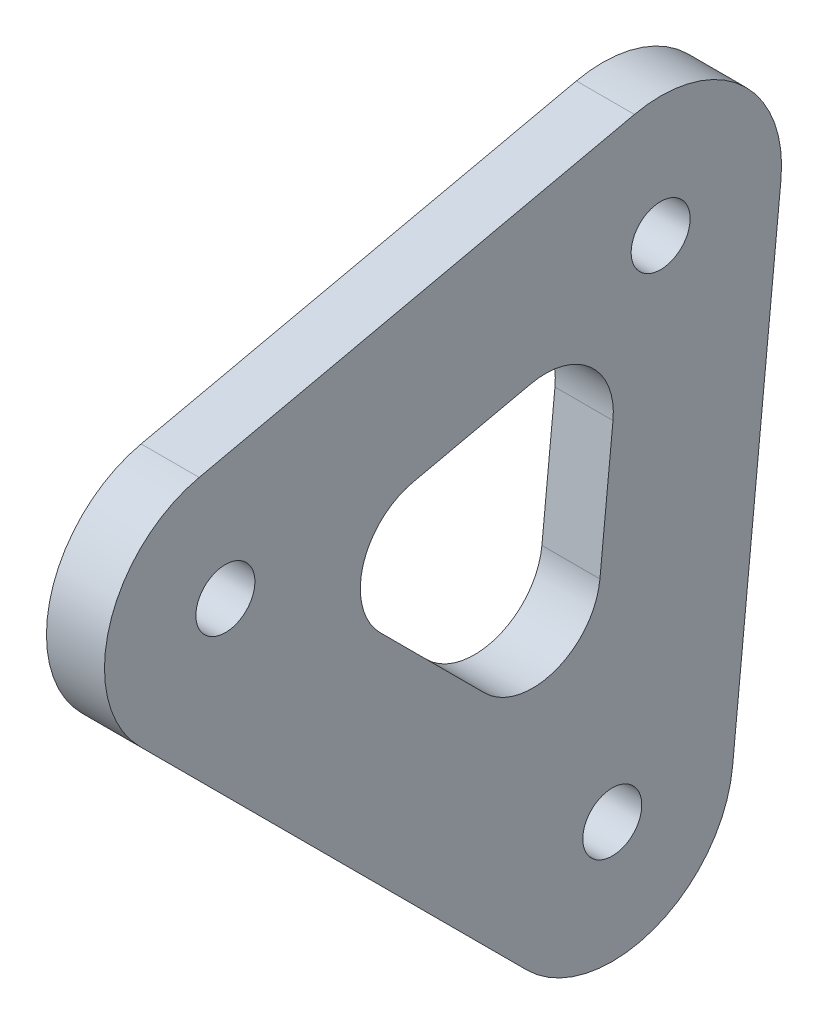
ISO-10303-21;
HEADER;
FILE_DESCRIPTION(('STEP AP214'),'2;1');
FILE_NAME('part.step','',(''),(''),'','','');
FILE_SCHEMA(('AUTOMOTIVE_DESIGN { 1 0 10303 214 1 1 1 1 }'));
ENDSEC;
DATA;
#1=APPLICATION_CONTEXT('core data for automotive mechanical design processes');
#2=APPLICATION_PROTOCOL_DEFINITION('international standard','automotive_design',2000,#1);
#3=PRODUCT_CONTEXT('',#1,'mechanical');
#4=PRODUCT('Part','Part','',(#3));
#5=PRODUCT_RELATED_PRODUCT_CATEGORY('part','',(#4));
#6=PRODUCT_DEFINITION_FORMATION('','',#4);
#7=PRODUCT_DEFINITION_CONTEXT('part definition',#1,'design');
#8=PRODUCT_DEFINITION('design','',#6,#7);
#9=PRODUCT_DEFINITION_SHAPE('','',#8);
#10=(LENGTH_UNIT() NAMED_UNIT(*) SI_UNIT(.MILLI.,.METRE.));
#11=(NAMED_UNIT(*) PLANE_ANGLE_UNIT() SI_UNIT($,.RADIAN.));
#12=(NAMED_UNIT(*) SI_UNIT($,.STERADIAN.) SOLID_ANGLE_UNIT());
#13=UNCERTAINTY_MEASURE_WITH_UNIT(LENGTH_MEASURE(1.E-05),#10,'distance_accuracy_value','');
#14=(GEOMETRIC_REPRESENTATION_CONTEXT(3) GLOBAL_UNCERTAINTY_ASSIGNED_CONTEXT((#13)) GLOBAL_UNIT_ASSIGNED_CONTEXT((#10,
#11,#12)) REPRESENTATION_CONTEXT('',''));
#15=CARTESIAN_POINT('',(0.,0.,0.));
#16=DIRECTION('',(0.,0.,1.));
#17=DIRECTION('',(1.,0.,0.));
#18=AXIS2_PLACEMENT_3D('',#15,#16,#17);
#19=CARTESIAN_POINT('',(-1.5,0.,0.));
#20=DIRECTION('',(1.,0.,0.));
#21=DIRECTION('',(0.,0.,-1.));
#22=AXIS2_PLACEMENT_3D('',#19,#20,#21);
#23=PLANE('',#22);
#24=CARTESIAN_POINT('',(-1.5,0.,0.));
#25=DIRECTION('',(-1.,0.,0.));
#26=DIRECTION('',(0.,0.,1.));
#27=AXIS2_PLACEMENT_3D('',#24,#25,#26);
#28=CIRCLE('',#27,1.525);
#29=CARTESIAN_POINT('',(-1.5,0.,1.525));
#30=VERTEX_POINT('',#29);
#31=EDGE_CURVE('E174',#30,#30,#28,.F.);
#32=ORIENTED_EDGE('',*,*,#31,.T.);
#33=EDGE_LOOP('',(#32));
#34=FACE_BOUND('',#33,.T.);
#35=CARTESIAN_POINT('',(-1.5,20.,20.));
#36=DIRECTION('',(-1.,0.,0.));
#37=DIRECTION('',(0.,0.,1.));
#38=AXIS2_PLACEMENT_3D('',#35,#36,#37);
#39=CIRCLE('',#38,1.525);
#40=CARTESIAN_POINT('',(-1.5,20.,21.525));
#41=VERTEX_POINT('',#40);
#42=EDGE_CURVE('E131',#41,#41,#39,.F.);
#43=ORIENTED_EDGE('',*,*,#42,.T.);
#44=EDGE_LOOP('',(#43));
#45=FACE_BOUND('',#44,.T.);
#46=DIRECTION('',(0.,-0.995037190209989,0.0995037190209988));
#47=VECTOR('',#46,1.);
#48=CARTESIAN_POINT('',(-1.5,-0.621898243881243,-6.21898243881244));
#49=LINE('',#48,#47);
#50=CARTESIAN_POINT('',(-1.5,24.3781017561188,-8.71898243881243));
#51=VERTEX_POINT('',#50);
#52=CARTESIAN_POINT('',(-1.5,-0.621898243881243,-6.21898243881244));
#53=VERTEX_POINT('',#52);
#54=EDGE_CURVE('E128',#51,#53,#49,.T.);
#55=ORIENTED_EDGE('',*,*,#54,.T.);
#56=CARTESIAN_POINT('',(-1.5,0.,0.));
#57=DIRECTION('',(-1.,0.,0.));
#58=DIRECTION('',(0.,0.,1.));
#59=AXIS2_PLACEMENT_3D('',#56,#57,#58);
#60=CIRCLE('',#59,6.25);
#61=CARTESIAN_POINT('',(-1.5,-4.41941738241592,4.41941738241592));
#62=VERTEX_POINT('',#61);
#63=EDGE_CURVE('E136',#62,#53,#60,.F.);
#64=ORIENTED_EDGE('',*,*,#63,.F.);
#65=DIRECTION('',(0.,0.707106781186548,0.707106781186548));
#66=VECTOR('',#65,1.);
#67=CARTESIAN_POINT('',(-1.5,-4.41941738241592,4.41941738241592));
#68=LINE('',#67,#66);
#69=CARTESIAN_POINT('',(-1.5,15.5805826175841,24.4194173824159));
#70=VERTEX_POINT('',#69);
#71=EDGE_CURVE('E133',#62,#70,#68,.T.);
#72=ORIENTED_EDGE('',*,*,#71,.T.);
#73=CARTESIAN_POINT('',(-1.5,20.,20.));
#74=DIRECTION('',(-1.,0.,0.));
#75=DIRECTION('',(0.,0.,1.));
#76=AXIS2_PLACEMENT_3D('',#73,#74,#75);
#77=CIRCLE('',#76,6.25);
#78=CARTESIAN_POINT('',(-1.5,26.1011691261497,21.3558153613666));
#79=VERTEX_POINT('',#78);
#80=EDGE_CURVE('E181',#79,#70,#77,.F.);
#81=ORIENTED_EDGE('',*,*,#80,.F.);
#82=DIRECTION('',(0.,-0.216930457818656,0.976187060183953));
#83=VECTOR('',#82,1.);
#84=CARTESIAN_POINT('',(-1.5,29.3952867732085,6.5322859496019));
#85=LINE('',#84,#83);
#86=CARTESIAN_POINT('',(-1.5,31.1011691261497,-1.1441846386334));
#87=VERTEX_POINT('',#86);
#88=EDGE_CURVE('E138',#87,#79,#85,.T.);
#89=ORIENTED_EDGE('',*,*,#88,.F.);
#90=CARTESIAN_POINT('',(-1.5,25.,-2.5));
#91=DIRECTION('',(-1.,0.,0.));
#92=DIRECTION('',(0.,0.,1.));
#93=AXIS2_PLACEMENT_3D('',#90,#91,#92);
#94=CIRCLE('',#93,6.25);
#95=EDGE_CURVE('E141',#51,#87,#94,.F.);
#96=ORIENTED_EDGE('',*,*,#95,.F.);
#97=EDGE_LOOP('',(#55,#64,#72,#81,#89,#96));
#98=FACE_BOUND('',#97,.T.);
#99=CARTESIAN_POINT('',(-1.5,25.,-2.5));
#100=DIRECTION('',(-1.,0.,0.));
#101=DIRECTION('',(0.,0.,1.));
#102=AXIS2_PLACEMENT_3D('',#99,#100,#101);
#103=CIRCLE('',#102,1.525);
#104=CARTESIAN_POINT('',(-1.5,25.,-0.974999999999998));
#105=VERTEX_POINT('',#104);
#106=EDGE_CURVE('E186',#105,#105,#103,.F.);
#107=ORIENTED_EDGE('',*,*,#106,.T.);
#108=EDGE_LOOP('',(#107));
#109=FACE_BOUND('',#108,.T.);
#110=CARTESIAN_POINT('',(-1.5,16.9496940003754,9.5250727979167));
#111=DIRECTION('',(-1.,0.,0.));
#112=DIRECTION('',(0.,0.,1.));
#113=AXIS2_PLACEMENT_3D('',#110,#111,#112);
#114=CIRCLE('',#113,3.5);
#115=CARTESIAN_POINT('',(-1.5,20.3663487110193,10.284329400282));
#116=VERTEX_POINT('',#115);
#117=CARTESIAN_POINT('',(-1.5,14.4748202662225,11.9999465320696));
#118=VERTEX_POINT('',#117);
#119=EDGE_CURVE('E190',#116,#118,#114,.F.);
#120=ORIENTED_EDGE('',*,*,#119,.T.);
#121=DIRECTION('',(0.,-0.707106781186547,-0.707106781186548));
#122=VECTOR('',#121,1.);
#123=CARTESIAN_POINT('',(-1.5,18.9832313334585,16.5083575993056));
#124=LINE('',#123,#122);
#125=CARTESIAN_POINT('',(-1.5,9.07131345089001,6.59643971673709));
#126=VERTEX_POINT('',#125);
#127=EDGE_CURVE('E102',#118,#126,#124,.T.);
#128=ORIENTED_EDGE('',*,*,#127,.T.);
#129=CARTESIAN_POINT('',(-1.5,11.5461871850429,4.12156598258418));
#130=DIRECTION('',(-1.,0.,0.));
#131=DIRECTION('',(0.,0.,1.));
#132=AXIS2_PLACEMENT_3D('',#129,#130,#131);
#133=CIRCLE('',#132,3.5);
#134=CARTESIAN_POINT('',(-1.5,11.1979241684694,0.638935816849212));
#135=VERTEX_POINT('',#134);
#136=EDGE_CURVE('E19',#126,#135,#133,.F.);
#137=ORIENTED_EDGE('',*,*,#136,.T.);
#138=DIRECTION('',(0.,0.995037190209989,-0.0995037190209988));
#139=VECTOR('',#138,1.);
#140=CARTESIAN_POINT('',(-1.5,3.84872906168098,1.37385532752806));
#141=LINE('',#140,#139);
#142=CARTESIAN_POINT('',(-1.5,17.9523076876351,-0.0365025350673508));
#143=VERTEX_POINT('',#142);
#144=EDGE_CURVE('E107',#135,#143,#141,.T.);
#145=ORIENTED_EDGE('',*,*,#144,.T.);
#146=CARTESIAN_POINT('',(-1.5,18.3005707042086,3.44612763066761));
#147=DIRECTION('',(-1.,0.,0.));
#148=DIRECTION('',(0.,0.,1.));
#149=AXIS2_PLACEMENT_3D('',#146,#147,#148);
#150=CIRCLE('',#149,3.5);
#151=CARTESIAN_POINT('',(-1.5,21.7172254148524,4.20538423303291));
#152=VERTEX_POINT('',#151);
#153=EDGE_CURVE('E189',#143,#152,#150,.F.);
#154=ORIENTED_EDGE('',*,*,#153,.T.);
#155=DIRECTION('',(0.,-0.216930457818656,0.976187060183953));
#156=VECTOR('',#155,1.);
#157=CARTESIAN_POINT('',(-1.5,22.7668569014029,-0.517957456444128));
#158=LINE('',#157,#156);
#159=EDGE_CURVE('E143',#152,#116,#158,.T.);
#160=ORIENTED_EDGE('',*,*,#159,.T.);
#161=EDGE_LOOP('',(#120,#128,#137,#145,#154,#160));
#162=FACE_BOUND('',#161,.T.);
#163=ADVANCED_FACE('F16',(#34,#45,#98,#109,#162),#23,.F.);
#164=CARTESIAN_POINT('',(-1.5,3.84872906168098,1.37385532752806));
#165=DIRECTION('',(0.,-0.0995037190209988,-0.995037190209989));
#166=DIRECTION('',(0.,0.995037190209989,-0.0995037190209988));
#167=AXIS2_PLACEMENT_3D('',#164,#165,#166);
#168=PLANE('',#167);
#169=DIRECTION('',(-1.,0.,0.));
#170=VECTOR('',#169,1.);
#171=CARTESIAN_POINT('',(-1.5,11.1979241684694,0.638935816849212));
#172=LINE('',#171,#170);
#173=CARTESIAN_POINT('',(1.5,11.1979241684694,0.638935816849212));
#174=VERTEX_POINT('',#173);
#175=EDGE_CURVE('E110',#135,#174,#172,.F.);
#176=ORIENTED_EDGE('',*,*,#175,.T.);
#177=DIRECTION('',(0.,-0.995037190209989,0.0995037190209988));
#178=VECTOR('',#177,1.);
#179=CARTESIAN_POINT('',(1.5,17.9523076876351,-0.0365025350673508));
#180=LINE('',#179,#178);
#181=CARTESIAN_POINT('',(1.5,17.9523076876351,-0.0365025350673508));
#182=VERTEX_POINT('',#181);
#183=EDGE_CURVE('E173',#182,#174,#180,.T.);
#184=ORIENTED_EDGE('',*,*,#183,.F.);
#185=DIRECTION('',(-1.,0.,0.));
#186=VECTOR('',#185,1.);
#187=CARTESIAN_POINT('',(-1.5,17.9523076876351,-0.0365025350673506));
#188=LINE('',#187,#186);
#189=EDGE_CURVE('E113',#182,#143,#188,.T.);
#190=ORIENTED_EDGE('',*,*,#189,.T.);
#191=ORIENTED_EDGE('',*,*,#144,.F.);
#192=EDGE_LOOP('',(#176,#184,#190,#191));
#193=FACE_BOUND('',#192,.T.);
#194=ADVANCED_FACE('F108',(#193),#168,.F.);
#195=CARTESIAN_POINT('',(-1.5,11.5461871850429,4.12156598258418));
#196=DIRECTION('',(-1.,0.,0.));
#197=DIRECTION('',(0.,0.,1.));
#198=AXIS2_PLACEMENT_3D('',#195,#196,#197);
#199=CYLINDRICAL_SURFACE('',#198,3.5);
#200=DIRECTION('',(1.,0.,0.));
#201=VECTOR('',#200,1.);
#202=CARTESIAN_POINT('',(-1.5,9.07131345089001,6.59643971673709));
#203=LINE('',#202,#201);
#204=CARTESIAN_POINT('',(1.5,9.07131345089001,6.59643971673709));
#205=VERTEX_POINT('',#204);
#206=EDGE_CURVE('E126',#126,#205,#203,.T.);
#207=ORIENTED_EDGE('',*,*,#206,.T.);
#208=CARTESIAN_POINT('',(1.5,11.5461871850429,4.12156598258418));
#209=DIRECTION('',(-1.,0.,0.));
#210=DIRECTION('',(0.,0.,1.));
#211=AXIS2_PLACEMENT_3D('',#208,#209,#210);
#212=CIRCLE('',#211,3.5);
#213=EDGE_CURVE('E121',#174,#205,#212,.T.);
#214=ORIENTED_EDGE('',*,*,#213,.F.);
#215=ORIENTED_EDGE('',*,*,#175,.F.);
#216=ORIENTED_EDGE('',*,*,#136,.F.);
#217=EDGE_LOOP('',(#207,#214,#215,#216));
#218=FACE_BOUND('',#217,.T.);
#219=ADVANCED_FACE('F119',(#218),#199,.F.);
#220=CARTESIAN_POINT('',(-1.5,18.9832313334585,16.5083575993056));
#221=DIRECTION('',(0.,-0.707106781186548,0.707106781186547));
#222=DIRECTION('',(0.,-0.707106781186547,-0.707106781186548));
#223=AXIS2_PLACEMENT_3D('',#220,#221,#222);
#224=PLANE('',#223);
#225=ORIENTED_EDGE('',*,*,#206,.F.);
#226=ORIENTED_EDGE('',*,*,#127,.F.);
#227=DIRECTION('',(-1.,0.,0.));
#228=VECTOR('',#227,1.);
#229=CARTESIAN_POINT('',(-1.5,14.4748202662225,11.9999465320696));
#230=LINE('',#229,#228);
#231=CARTESIAN_POINT('',(1.5,14.4748202662225,11.9999465320696));
#232=VERTEX_POINT('',#231);
#233=EDGE_CURVE('E191',#118,#232,#230,.F.);
#234=ORIENTED_EDGE('',*,*,#233,.T.);
#235=DIRECTION('',(0.,0.707106781186548,0.707106781186548));
#236=VECTOR('',#235,1.);
#237=CARTESIAN_POINT('',(1.5,9.07131345089001,6.59643971673709));
#238=LINE('',#237,#236);
#239=EDGE_CURVE('E171',#205,#232,#238,.T.);
#240=ORIENTED_EDGE('',*,*,#239,.F.);
#241=EDGE_LOOP('',(#225,#226,#234,#240));
#242=FACE_BOUND('',#241,.T.);
#243=ADVANCED_FACE('F300',(#242),#224,.F.);
#244=CARTESIAN_POINT('',(-1.5,16.9496940003754,9.5250727979167));
#245=DIRECTION('',(-1.,0.,0.));
#246=DIRECTION('',(0.,0.,1.));
#247=AXIS2_PLACEMENT_3D('',#244,#245,#246);
#248=CYLINDRICAL_SURFACE('',#247,3.5);
#249=DIRECTION('',(1.,0.,0.));
#250=VECTOR('',#249,1.);
#251=CARTESIAN_POINT('',(-1.5,20.3663487110193,10.284329400282));
#252=LINE('',#251,#250);
#253=CARTESIAN_POINT('',(1.5,20.3663487110193,10.284329400282));
#254=VERTEX_POINT('',#253);
#255=EDGE_CURVE('E147',#116,#254,#252,.T.);
#256=ORIENTED_EDGE('',*,*,#255,.T.);
#257=CARTESIAN_POINT('',(1.5,16.9496940003754,9.5250727979167));
#258=DIRECTION('',(-1.,0.,0.));
#259=DIRECTION('',(0.,0.,1.));
#260=AXIS2_PLACEMENT_3D('',#257,#258,#259);
#261=CIRCLE('',#260,3.5);
#262=EDGE_CURVE('E169',#232,#254,#261,.T.);
#263=ORIENTED_EDGE('',*,*,#262,.F.);
#264=ORIENTED_EDGE('',*,*,#233,.F.);
#265=ORIENTED_EDGE('',*,*,#119,.F.);
#266=EDGE_LOOP('',(#256,#263,#264,#265));
#267=FACE_BOUND('',#266,.T.);
#268=ADVANCED_FACE('F296',(#267),#248,.F.);
#269=CARTESIAN_POINT('',(-1.5,22.7668569014029,-0.517957456444128));
#270=DIRECTION('',(0.,0.976187060183953,0.216930457818656));
#271=DIRECTION('',(0.,-0.216930457818656,0.976187060183953));
#272=AXIS2_PLACEMENT_3D('',#269,#270,#271);
#273=PLANE('',#272);
#274=DIRECTION('',(-1.,0.,0.));
#275=VECTOR('',#274,1.);
#276=CARTESIAN_POINT('',(-1.5,21.7172254148524,4.20538423303291));
#277=LINE('',#276,#275);
#278=CARTESIAN_POINT('',(1.5,21.7172254148524,4.20538423303291));
#279=VERTEX_POINT('',#278);
#280=EDGE_CURVE('E146',#152,#279,#277,.F.);
#281=ORIENTED_EDGE('',*,*,#280,.T.);
#282=DIRECTION('',(0.,0.216930457818656,-0.976187060183953));
#283=VECTOR('',#282,1.);
#284=CARTESIAN_POINT('',(1.5,20.3663487110193,10.284329400282));
#285=LINE('',#284,#283);
#286=EDGE_CURVE('E168',#254,#279,#285,.T.);
#287=ORIENTED_EDGE('',*,*,#286,.F.);
#288=ORIENTED_EDGE('',*,*,#255,.F.);
#289=ORIENTED_EDGE('',*,*,#159,.F.);
#290=EDGE_LOOP('',(#281,#287,#288,#289));
#291=FACE_BOUND('',#290,.T.);
#292=ADVANCED_FACE('F288',(#291),#273,.F.);
#293=CARTESIAN_POINT('',(-1.5,18.3005707042086,3.44612763066761));
#294=DIRECTION('',(-1.,0.,0.));
#295=DIRECTION('',(0.,0.,1.));
#296=AXIS2_PLACEMENT_3D('',#293,#294,#295);
#297=CYLINDRICAL_SURFACE('',#296,3.5);
#298=ORIENTED_EDGE('',*,*,#189,.F.);
#299=CARTESIAN_POINT('',(1.5,18.3005707042086,3.44612763066761));
#300=DIRECTION('',(-1.,0.,0.));
#301=DIRECTION('',(0.,0.,1.));
#302=AXIS2_PLACEMENT_3D('',#299,#300,#301);
#303=CIRCLE('',#302,3.5);
#304=EDGE_CURVE('E165',#279,#182,#303,.T.);
#305=ORIENTED_EDGE('',*,*,#304,.F.);
#306=ORIENTED_EDGE('',*,*,#280,.F.);
#307=ORIENTED_EDGE('',*,*,#153,.F.);
#308=EDGE_LOOP('',(#298,#305,#306,#307));
#309=FACE_BOUND('',#308,.T.);
#310=ADVANCED_FACE('F280',(#309),#297,.F.);
#311=CARTESIAN_POINT('',(1.5,25.,-2.5));
#312=DIRECTION('',(-1.,0.,0.));
#313=DIRECTION('',(0.,0.,1.));
#314=AXIS2_PLACEMENT_3D('',#311,#312,#313);
#315=CYLINDRICAL_SURFACE('',#314,1.525);
#316=CARTESIAN_POINT('',(1.5,25.,-2.5));
#317=DIRECTION('',(-1.,0.,0.));
#318=DIRECTION('',(0.,0.,1.));
#319=AXIS2_PLACEMENT_3D('',#316,#317,#318);
#320=CIRCLE('',#319,1.525);
#321=CARTESIAN_POINT('',(1.5,25.,-0.974999999999998));
#322=VERTEX_POINT('',#321);
#323=EDGE_CURVE('E162',#322,#322,#320,.T.);
#324=ORIENTED_EDGE('',*,*,#323,.F.);
#325=EDGE_LOOP('',(#324));
#326=FACE_BOUND('',#325,.T.);
#327=ORIENTED_EDGE('',*,*,#106,.F.);
#328=EDGE_LOOP('',(#327));
#329=FACE_BOUND('',#328,.T.);
#330=ADVANCED_FACE('F278',(#326,#329),#315,.F.);
#331=CARTESIAN_POINT('',(1.5,25.,-2.5));
#332=DIRECTION('',(-1.,0.,0.));
#333=DIRECTION('',(0.,0.,1.));
#334=AXIS2_PLACEMENT_3D('',#331,#332,#333);
#335=CYLINDRICAL_SURFACE('',#334,6.25);
#336=CARTESIAN_POINT('',(1.5,25.,-2.5));
#337=DIRECTION('',(-1.,0.,0.));
#338=DIRECTION('',(0.,0.,1.));
#339=AXIS2_PLACEMENT_3D('',#336,#337,#338);
#340=CIRCLE('',#339,6.25);
#341=CARTESIAN_POINT('',(1.5,24.3781017561188,-8.71898243881243));
#342=VERTEX_POINT('',#341);
#343=CARTESIAN_POINT('',(1.5,31.1011691261497,-1.1441846386334));
#344=VERTEX_POINT('',#343);
#345=EDGE_CURVE('E159',#342,#344,#340,.F.);
#346=ORIENTED_EDGE('',*,*,#345,.F.);
#347=DIRECTION('',(1.,0.,0.));
#348=VECTOR('',#347,1.);
#349=CARTESIAN_POINT('',(1.5,24.3781017561188,-8.71898243881243));
#350=LINE('',#349,#348);
#351=EDGE_CURVE('E132',#342,#51,#350,.F.);
#352=ORIENTED_EDGE('',*,*,#351,.T.);
#353=ORIENTED_EDGE('',*,*,#95,.T.);
#354=DIRECTION('',(1.,0.,0.));
#355=VECTOR('',#354,1.);
#356=CARTESIAN_POINT('',(1.5,31.1011691261497,-1.1441846386334));
#357=LINE('',#356,#355);
#358=EDGE_CURVE('E140',#344,#87,#357,.F.);
#359=ORIENTED_EDGE('',*,*,#358,.F.);
#360=EDGE_LOOP('',(#346,#352,#353,#359));
#361=FACE_BOUND('',#360,.T.);
#362=ADVANCED_FACE('F230',(#361),#335,.T.);
#363=CARTESIAN_POINT('',(1.5,29.3952867732085,6.5322859496019));
#364=DIRECTION('',(0.,0.976187060183953,0.216930457818656));
#365=DIRECTION('',(0.,-0.216930457818656,0.976187060183953));
#366=AXIS2_PLACEMENT_3D('',#363,#364,#365);
#367=PLANE('',#366);
#368=DIRECTION('',(0.,-0.216930457818656,0.976187060183953));
#369=VECTOR('',#368,1.);
#370=CARTESIAN_POINT('',(1.5,31.1011691261497,-1.1441846386334));
#371=LINE('',#370,#369);
#372=CARTESIAN_POINT('',(1.5,26.1011691261497,21.3558153613666));
#373=VERTEX_POINT('',#372);
#374=EDGE_CURVE('E158',#344,#373,#371,.T.);
#375=ORIENTED_EDGE('',*,*,#374,.F.);
#376=ORIENTED_EDGE('',*,*,#358,.T.);
#377=ORIENTED_EDGE('',*,*,#88,.T.);
#378=DIRECTION('',(-1.,0.,0.));
#379=VECTOR('',#378,1.);
#380=CARTESIAN_POINT('',(1.5,26.1011691261497,21.3558153613666));
#381=LINE('',#380,#379);
#382=EDGE_CURVE('E183',#373,#79,#381,.T.);
#383=ORIENTED_EDGE('',*,*,#382,.F.);
#384=EDGE_LOOP('',(#375,#376,#377,#383));
#385=FACE_BOUND('',#384,.T.);
#386=ADVANCED_FACE('F233',(#385),#367,.T.);
#387=CARTESIAN_POINT('',(1.5,20.,20.));
#388=DIRECTION('',(-1.,0.,0.));
#389=DIRECTION('',(0.,0.,1.));
#390=AXIS2_PLACEMENT_3D('',#387,#388,#389);
#391=CYLINDRICAL_SURFACE('',#390,6.25);
#392=ORIENTED_EDGE('',*,*,#80,.T.);
#393=DIRECTION('',(1.,0.,0.));
#394=VECTOR('',#393,1.);
#395=CARTESIAN_POINT('',(1.5,15.5805826175841,24.4194173824159));
#396=LINE('',#395,#394);
#397=CARTESIAN_POINT('',(1.5,15.5805826175841,24.4194173824159));
#398=VERTEX_POINT('',#397);
#399=EDGE_CURVE('E137',#70,#398,#396,.T.);
#400=ORIENTED_EDGE('',*,*,#399,.T.);
#401=CARTESIAN_POINT('',(1.5,20.,20.));
#402=DIRECTION('',(-1.,0.,0.));
#403=DIRECTION('',(0.,0.,1.));
#404=AXIS2_PLACEMENT_3D('',#401,#402,#403);
#405=CIRCLE('',#404,6.25);
#406=EDGE_CURVE('E156',#373,#398,#405,.F.);
#407=ORIENTED_EDGE('',*,*,#406,.F.);
#408=ORIENTED_EDGE('',*,*,#382,.T.);
#409=EDGE_LOOP('',(#392,#400,#407,#408));
#410=FACE_BOUND('',#409,.T.);
#411=ADVANCED_FACE('F238',(#410),#391,.T.);
#412=CARTESIAN_POINT('',(1.5,-4.41941738241592,4.41941738241592));
#413=DIRECTION('',(0.,0.707106781186548,-0.707106781186548));
#414=DIRECTION('',(0.,0.707106781186548,0.707106781186548));
#415=AXIS2_PLACEMENT_3D('',#412,#413,#414);
#416=PLANE('',#415);
#417=DIRECTION('',(-1.,0.,0.));
#418=VECTOR('',#417,1.);
#419=CARTESIAN_POINT('',(1.5,-4.41941738241592,4.41941738241592));
#420=LINE('',#419,#418);
#421=CARTESIAN_POINT('',(1.5,-4.41941738241592,4.41941738241592));
#422=VERTEX_POINT('',#421);
#423=EDGE_CURVE('E180',#422,#62,#420,.T.);
#424=ORIENTED_EDGE('',*,*,#423,.F.);
#425=DIRECTION('',(0.,-0.707106781186547,-0.707106781186548));
#426=VECTOR('',#425,1.);
#427=CARTESIAN_POINT('',(1.5,15.5805826175841,24.4194173824159));
#428=LINE('',#427,#426);
#429=EDGE_CURVE('E155',#398,#422,#428,.T.);
#430=ORIENTED_EDGE('',*,*,#429,.F.);
#431=ORIENTED_EDGE('',*,*,#399,.F.);
#432=ORIENTED_EDGE('',*,*,#71,.F.);
#433=EDGE_LOOP('',(#424,#430,#431,#432));
#434=FACE_BOUND('',#433,.T.);
#435=ADVANCED_FACE('F241',(#434),#416,.F.);
#436=CARTESIAN_POINT('',(1.5,0.,0.));
#437=DIRECTION('',(-1.,0.,0.));
#438=DIRECTION('',(0.,0.,1.));
#439=AXIS2_PLACEMENT_3D('',#436,#437,#438);
#440=CYLINDRICAL_SURFACE('',#439,6.25);
#441=CARTESIAN_POINT('',(1.5,0.,0.));
#442=DIRECTION('',(-1.,0.,0.));
#443=DIRECTION('',(0.,0.,1.));
#444=AXIS2_PLACEMENT_3D('',#441,#442,#443);
#445=CIRCLE('',#444,6.25);
#446=CARTESIAN_POINT('',(1.5,-0.621898243881243,-6.21898243881244));
#447=VERTEX_POINT('',#446);
#448=EDGE_CURVE('E152',#422,#447,#445,.F.);
#449=ORIENTED_EDGE('',*,*,#448,.F.);
#450=ORIENTED_EDGE('',*,*,#423,.T.);
#451=ORIENTED_EDGE('',*,*,#63,.T.);
#452=DIRECTION('',(1.,0.,0.));
#453=VECTOR('',#452,1.);
#454=CARTESIAN_POINT('',(1.5,-0.621898243881243,-6.21898243881244));
#455=LINE('',#454,#453);
#456=EDGE_CURVE('E34',#53,#447,#455,.T.);
#457=ORIENTED_EDGE('',*,*,#456,.T.);
#458=EDGE_LOOP('',(#449,#450,#451,#457));
#459=FACE_BOUND('',#458,.T.);
#460=ADVANCED_FACE('F242',(#459),#440,.T.);
#461=CARTESIAN_POINT('',(1.5,-0.621898243881243,-6.21898243881244));
#462=DIRECTION('',(0.,0.0995037190209988,0.995037190209989));
#463=DIRECTION('',(0.,-0.995037190209989,0.0995037190209988));
#464=AXIS2_PLACEMENT_3D('',#461,#462,#463);
#465=PLANE('',#464);
#466=ORIENTED_EDGE('',*,*,#351,.F.);
#467=DIRECTION('',(0.,0.995037190209989,-0.0995037190209987));
#468=VECTOR('',#467,1.);
#469=CARTESIAN_POINT('',(1.5,-0.621898243881243,-6.21898243881243));
#470=LINE('',#469,#468);
#471=EDGE_CURVE('E151',#447,#342,#470,.T.);
#472=ORIENTED_EDGE('',*,*,#471,.F.);
#473=ORIENTED_EDGE('',*,*,#456,.F.);
#474=ORIENTED_EDGE('',*,*,#54,.F.);
#475=EDGE_LOOP('',(#466,#472,#473,#474));
#476=FACE_BOUND('',#475,.T.);
#477=ADVANCED_FACE('F227',(#476),#465,.F.);
#478=CARTESIAN_POINT('',(1.5,20.,20.));
#479=DIRECTION('',(-1.,0.,0.));
#480=DIRECTION('',(0.,0.,1.));
#481=AXIS2_PLACEMENT_3D('',#478,#479,#480);
#482=CYLINDRICAL_SURFACE('',#481,1.525);
#483=CARTESIAN_POINT('',(1.5,20.,20.));
#484=DIRECTION('',(-1.,0.,0.));
#485=DIRECTION('',(0.,0.,1.));
#486=AXIS2_PLACEMENT_3D('',#483,#484,#485);
#487=CIRCLE('',#486,1.525);
#488=CARTESIAN_POINT('',(1.5,20.,21.525));
#489=VERTEX_POINT('',#488);
#490=EDGE_CURVE('E25',#489,#489,#487,.T.);
#491=ORIENTED_EDGE('',*,*,#490,.F.);
#492=EDGE_LOOP('',(#491));
#493=FACE_BOUND('',#492,.T.);
#494=ORIENTED_EDGE('',*,*,#42,.F.);
#495=EDGE_LOOP('',(#494));
#496=FACE_BOUND('',#495,.T.);
#497=ADVANCED_FACE('F250',(#493,#496),#482,.F.);
#498=CARTESIAN_POINT('',(1.5,0.,0.));
#499=DIRECTION('',(-1.,0.,0.));
#500=DIRECTION('',(0.,0.,1.));
#501=AXIS2_PLACEMENT_3D('',#498,#499,#500);
#502=CYLINDRICAL_SURFACE('',#501,1.525);
#503=CARTESIAN_POINT('',(1.5,0.,0.));
#504=DIRECTION('',(-1.,0.,0.));
#505=DIRECTION('',(0.,0.,1.));
#506=AXIS2_PLACEMENT_3D('',#503,#504,#505);
#507=CIRCLE('',#506,1.525);
#508=CARTESIAN_POINT('',(1.5,0.,1.525));
#509=VERTEX_POINT('',#508);
#510=EDGE_CURVE('E11',#509,#509,#507,.T.);
#511=ORIENTED_EDGE('',*,*,#510,.F.);
#512=EDGE_LOOP('',(#511));
#513=FACE_BOUND('',#512,.T.);
#514=ORIENTED_EDGE('',*,*,#31,.F.);
#515=EDGE_LOOP('',(#514));
#516=FACE_BOUND('',#515,.T.);
#517=ADVANCED_FACE('F254',(#513,#516),#502,.F.);
#518=CARTESIAN_POINT('',(1.5,0.,0.));
#519=DIRECTION('',(1.,0.,0.));
#520=DIRECTION('',(0.,0.,-1.));
#521=AXIS2_PLACEMENT_3D('',#518,#519,#520);
#522=PLANE('',#521);
#523=ORIENTED_EDGE('',*,*,#510,.T.);
#524=EDGE_LOOP('',(#523));
#525=FACE_BOUND('',#524,.T.);
#526=ORIENTED_EDGE('',*,*,#490,.T.);
#527=EDGE_LOOP('',(#526));
#528=FACE_BOUND('',#527,.T.);
#529=ORIENTED_EDGE('',*,*,#448,.T.);
#530=ORIENTED_EDGE('',*,*,#471,.T.);
#531=ORIENTED_EDGE('',*,*,#345,.T.);
#532=ORIENTED_EDGE('',*,*,#374,.T.);
#533=ORIENTED_EDGE('',*,*,#406,.T.);
#534=ORIENTED_EDGE('',*,*,#429,.T.);
#535=EDGE_LOOP('',(#529,#530,#531,#532,#533,#534));
#536=FACE_BOUND('',#535,.T.);
#537=ORIENTED_EDGE('',*,*,#323,.T.);
#538=EDGE_LOOP('',(#537));
#539=FACE_BOUND('',#538,.T.);
#540=ORIENTED_EDGE('',*,*,#286,.T.);
#541=ORIENTED_EDGE('',*,*,#304,.T.);
#542=ORIENTED_EDGE('',*,*,#183,.T.);
#543=ORIENTED_EDGE('',*,*,#213,.T.);
#544=ORIENTED_EDGE('',*,*,#239,.T.);
#545=ORIENTED_EDGE('',*,*,#262,.T.);
#546=EDGE_LOOP('',(#540,#541,#542,#543,#544,#545));
#547=FACE_BOUND('',#546,.T.);
#548=ADVANCED_FACE('F223',(#525,#528,#536,#539,#547),#522,.T.);
#549=CLOSED_SHELL('',(#163,#194,#219,#243,#268,#292,#310,#330,#362,#386,#411,#435,#460,#477,
#497,#517,#548));
#550=MANIFOLD_SOLID_BREP('B1',#549);
#551=ADVANCED_BREP_SHAPE_REPRESENTATION('',(#18,#550),#14);
#552=SHAPE_DEFINITION_REPRESENTATION(#9,#551);
ENDSEC;
END-ISO-10303-21;
